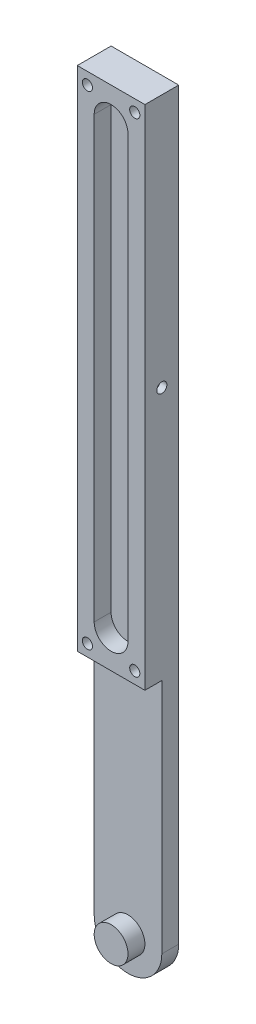
ISO-10303-21;
HEADER;
FILE_DESCRIPTION(('STEP AP214'),'2;1');
FILE_NAME('part.step','',(''),(''),'','','');
FILE_SCHEMA(('AUTOMOTIVE_DESIGN { 1 0 10303 214 1 1 1 1 }'));
ENDSEC;
DATA;
#1=APPLICATION_CONTEXT('core data for automotive mechanical design processes');
#2=APPLICATION_PROTOCOL_DEFINITION('international standard','automotive_design',2000,#1);
#3=PRODUCT_CONTEXT('',#1,'mechanical');
#4=PRODUCT('Part','Part','',(#3));
#5=PRODUCT_RELATED_PRODUCT_CATEGORY('part','',(#4));
#6=PRODUCT_DEFINITION_FORMATION('','',#4);
#7=PRODUCT_DEFINITION_CONTEXT('part definition',#1,'design');
#8=PRODUCT_DEFINITION('design','',#6,#7);
#9=PRODUCT_DEFINITION_SHAPE('','',#8);
#10=(LENGTH_UNIT() NAMED_UNIT(*) SI_UNIT(.MILLI.,.METRE.));
#11=(NAMED_UNIT(*) PLANE_ANGLE_UNIT() SI_UNIT($,.RADIAN.));
#12=(NAMED_UNIT(*) SI_UNIT($,.STERADIAN.) SOLID_ANGLE_UNIT());
#13=UNCERTAINTY_MEASURE_WITH_UNIT(LENGTH_MEASURE(1.E-05),#10,'distance_accuracy_value','');
#14=(GEOMETRIC_REPRESENTATION_CONTEXT(3) GLOBAL_UNCERTAINTY_ASSIGNED_CONTEXT((#13)) GLOBAL_UNIT_ASSIGNED_CONTEXT((#10,
#11,#12)) REPRESENTATION_CONTEXT('',''));
#15=CARTESIAN_POINT('',(0.,0.,0.));
#16=DIRECTION('',(0.,0.,1.));
#17=DIRECTION('',(1.,0.,0.));
#18=AXIS2_PLACEMENT_3D('',#15,#16,#17);
#19=CARTESIAN_POINT('',(10.,-150.,5.));
#20=DIRECTION('',(-1.,0.,0.));
#21=DIRECTION('',(0.,-1.,0.));
#22=AXIS2_PLACEMENT_3D('',#19,#20,#21);
#23=PLANE('',#22);
#24=DIRECTION('',(0.,1.,0.));
#25=VECTOR('',#24,1.);
#26=CARTESIAN_POINT('',(10.,-150.,-5.));
#27=LINE('',#26,#25);
#28=CARTESIAN_POINT('',(10.,-220.,-5.));
#29=VERTEX_POINT('',#28);
#30=CARTESIAN_POINT('',(10.,0.,-5.));
#31=VERTEX_POINT('',#30);
#32=EDGE_CURVE('E94',#29,#31,#27,.T.);
#33=ORIENTED_EDGE('',*,*,#32,.T.);
#34=DIRECTION('',(0.,0.,-1.));
#35=VECTOR('',#34,1.);
#36=CARTESIAN_POINT('',(10.,0.,5.));
#37=LINE('',#36,#35);
#38=CARTESIAN_POINT('',(10.,0.,5.));
#39=VERTEX_POINT('',#38);
#40=EDGE_CURVE('E10',#39,#31,#37,.T.);
#41=ORIENTED_EDGE('',*,*,#40,.F.);
#42=DIRECTION('',(0.,1.,0.));
#43=VECTOR('',#42,1.);
#44=CARTESIAN_POINT('',(10.,-150.,5.));
#45=LINE('',#44,#43);
#46=CARTESIAN_POINT('',(10.,-150.,5.));
#47=VERTEX_POINT('',#46);
#48=EDGE_CURVE('E177',#47,#39,#45,.T.);
#49=ORIENTED_EDGE('',*,*,#48,.F.);
#50=DIRECTION('',(0.,0.,-1.));
#51=VECTOR('',#50,1.);
#52=CARTESIAN_POINT('',(10.,-150.,5.));
#53=LINE('',#52,#51);
#54=CARTESIAN_POINT('',(10.,-150.,0.));
#55=VERTEX_POINT('',#54);
#56=EDGE_CURVE('E186',#47,#55,#53,.T.);
#57=ORIENTED_EDGE('',*,*,#56,.T.);
#58=DIRECTION('',(0.,1.,0.));
#59=VECTOR('',#58,1.);
#60=CARTESIAN_POINT('',(10.,-150.,0.));
#61=LINE('',#60,#59);
#62=CARTESIAN_POINT('',(10.,-220.,0.));
#63=VERTEX_POINT('',#62);
#64=EDGE_CURVE('E110',#63,#55,#61,.T.);
#65=ORIENTED_EDGE('',*,*,#64,.F.);
#66=DIRECTION('',(0.,0.,1.));
#67=VECTOR('',#66,1.);
#68=CARTESIAN_POINT('',(10.,-220.,-87.4621125123532));
#69=LINE('',#68,#67);
#70=EDGE_CURVE('E107',#29,#63,#69,.T.);
#71=ORIENTED_EDGE('',*,*,#70,.F.);
#72=EDGE_LOOP('',(#33,#41,#49,#57,#65,#71));
#73=FACE_BOUND('',#72,.T.);
#74=CARTESIAN_POINT('',(10.,-75.,0.));
#75=DIRECTION('',(-1.,0.,0.));
#76=DIRECTION('',(0.,-1.,0.));
#77=AXIS2_PLACEMENT_3D('',#74,#75,#76);
#78=CIRCLE('',#77,1.5);
#79=CARTESIAN_POINT('',(10.,-76.5,0.));
#80=VERTEX_POINT('',#79);
#81=EDGE_CURVE('E211',#80,#80,#78,.T.);
#82=ORIENTED_EDGE('',*,*,#81,.T.);
#83=EDGE_LOOP('',(#82));
#84=FACE_BOUND('',#83,.T.);
#85=ADVANCED_FACE('F15',(#73,#84),#23,.F.);
#86=CARTESIAN_POINT('',(0.,-220.,0.));
#87=DIRECTION('',(0.,0.,1.));
#88=DIRECTION('',(0.,-1.,0.));
#89=AXIS2_PLACEMENT_3D('',#86,#87,#88);
#90=PLANE('',#89);
#91=DIRECTION('',(0.,-1.,0.));
#92=VECTOR('',#91,1.);
#93=CARTESIAN_POINT('',(-10.,-150.,0.));
#94=LINE('',#93,#92);
#95=CARTESIAN_POINT('',(-10.,-150.,0.));
#96=VERTEX_POINT('',#95);
#97=CARTESIAN_POINT('',(-10.,-220.,0.));
#98=VERTEX_POINT('',#97);
#99=EDGE_CURVE('E198',#96,#98,#94,.T.);
#100=ORIENTED_EDGE('',*,*,#99,.T.);
#101=CARTESIAN_POINT('',(0.,-220.,0.));
#102=DIRECTION('',(0.,0.,1.));
#103=DIRECTION('',(0.,-1.,0.));
#104=AXIS2_PLACEMENT_3D('',#101,#102,#103);
#105=CIRCLE('',#104,10.);
#106=EDGE_CURVE('E120',#98,#63,#105,.T.);
#107=ORIENTED_EDGE('',*,*,#106,.T.);
#108=ORIENTED_EDGE('',*,*,#64,.T.);
#109=DIRECTION('',(-1.,0.,0.));
#110=VECTOR('',#109,1.);
#111=CARTESIAN_POINT('',(-10.,-150.,0.));
#112=LINE('',#111,#110);
#113=EDGE_CURVE('E31',#55,#96,#112,.T.);
#114=ORIENTED_EDGE('',*,*,#113,.T.);
#115=EDGE_LOOP('',(#100,#107,#108,#114));
#116=FACE_BOUND('',#115,.T.);
#117=CARTESIAN_POINT('',(0.,-220.,0.));
#118=DIRECTION('',(0.,0.,1.));
#119=DIRECTION('',(0.,-1.,0.));
#120=AXIS2_PLACEMENT_3D('',#117,#118,#119);
#121=CIRCLE('',#120,5.);
#122=CARTESIAN_POINT('',(0.,-225.,0.));
#123=VERTEX_POINT('',#122);
#124=EDGE_CURVE('E205',#123,#123,#121,.T.);
#125=ORIENTED_EDGE('',*,*,#124,.F.);
#126=EDGE_LOOP('',(#125));
#127=FACE_BOUND('',#126,.T.);
#128=ADVANCED_FACE('F230',(#116,#127),#90,.T.);
#129=CARTESIAN_POINT('',(-10.,-150.,5.));
#130=DIRECTION('',(0.,1.,0.));
#131=DIRECTION('',(-1.,0.,0.));
#132=AXIS2_PLACEMENT_3D('',#129,#130,#131);
#133=PLANE('',#132);
#134=ORIENTED_EDGE('',*,*,#113,.F.);
#135=ORIENTED_EDGE('',*,*,#56,.F.);
#136=DIRECTION('',(1.,0.,0.));
#137=VECTOR('',#136,1.);
#138=CARTESIAN_POINT('',(-10.,-150.,5.));
#139=LINE('',#138,#137);
#140=CARTESIAN_POINT('',(-10.,-150.,5.));
#141=VERTEX_POINT('',#140);
#142=EDGE_CURVE('E185',#141,#47,#139,.T.);
#143=ORIENTED_EDGE('',*,*,#142,.F.);
#144=DIRECTION('',(0.,0.,-1.));
#145=VECTOR('',#144,1.);
#146=CARTESIAN_POINT('',(-10.,-150.,5.));
#147=LINE('',#146,#145);
#148=EDGE_CURVE('E196',#141,#96,#147,.T.);
#149=ORIENTED_EDGE('',*,*,#148,.T.);
#150=EDGE_LOOP('',(#134,#135,#143,#149));
#151=FACE_BOUND('',#150,.T.);
#152=ADVANCED_FACE('F234',(#151),#133,.F.);
#153=CARTESIAN_POINT('',(-10.,0.,5.));
#154=DIRECTION('',(0.,-1.,0.));
#155=DIRECTION('',(1.,0.,0.));
#156=AXIS2_PLACEMENT_3D('',#153,#154,#155);
#157=PLANE('',#156);
#158=DIRECTION('',(-1.,0.,0.));
#159=VECTOR('',#158,1.);
#160=CARTESIAN_POINT('',(-10.,0.,-5.));
#161=LINE('',#160,#159);
#162=CARTESIAN_POINT('',(-10.,0.,-5.));
#163=VERTEX_POINT('',#162);
#164=EDGE_CURVE('E101',#31,#163,#161,.T.);
#165=ORIENTED_EDGE('',*,*,#164,.T.);
#166=DIRECTION('',(0.,0.,-1.));
#167=VECTOR('',#166,1.);
#168=CARTESIAN_POINT('',(-10.,0.,5.));
#169=LINE('',#168,#167);
#170=CARTESIAN_POINT('',(-10.,0.,5.));
#171=VERTEX_POINT('',#170);
#172=EDGE_CURVE('E23',#171,#163,#169,.T.);
#173=ORIENTED_EDGE('',*,*,#172,.F.);
#174=DIRECTION('',(-1.,0.,0.));
#175=VECTOR('',#174,1.);
#176=CARTESIAN_POINT('',(-10.,0.,5.));
#177=LINE('',#176,#175);
#178=EDGE_CURVE('E180',#39,#171,#177,.T.);
#179=ORIENTED_EDGE('',*,*,#178,.F.);
#180=ORIENTED_EDGE('',*,*,#40,.T.);
#181=EDGE_LOOP('',(#165,#173,#179,#180));
#182=FACE_BOUND('',#181,.T.);
#183=ADVANCED_FACE('F240',(#182),#157,.F.);
#184=CARTESIAN_POINT('',(-10.,-150.,5.));
#185=DIRECTION('',(1.,0.,0.));
#186=DIRECTION('',(0.,1.,0.));
#187=AXIS2_PLACEMENT_3D('',#184,#185,#186);
#188=PLANE('',#187);
#189=DIRECTION('',(0.,-1.,0.));
#190=VECTOR('',#189,1.);
#191=CARTESIAN_POINT('',(-10.,-150.,-5.));
#192=LINE('',#191,#190);
#193=CARTESIAN_POINT('',(-10.,-220.,-5.));
#194=VERTEX_POINT('',#193);
#195=EDGE_CURVE('E181',#163,#194,#192,.T.);
#196=ORIENTED_EDGE('',*,*,#195,.T.);
#197=DIRECTION('',(0.,0.,1.));
#198=VECTOR('',#197,1.);
#199=CARTESIAN_POINT('',(-10.,-220.,-87.4621125123532));
#200=LINE('',#199,#198);
#201=EDGE_CURVE('E114',#194,#98,#200,.T.);
#202=ORIENTED_EDGE('',*,*,#201,.T.);
#203=ORIENTED_EDGE('',*,*,#99,.F.);
#204=ORIENTED_EDGE('',*,*,#148,.F.);
#205=DIRECTION('',(0.,-1.,0.));
#206=VECTOR('',#205,1.);
#207=CARTESIAN_POINT('',(-10.,-150.,5.));
#208=LINE('',#207,#206);
#209=EDGE_CURVE('E183',#171,#141,#208,.T.);
#210=ORIENTED_EDGE('',*,*,#209,.F.);
#211=ORIENTED_EDGE('',*,*,#172,.T.);
#212=EDGE_LOOP('',(#196,#202,#203,#204,#210,#211));
#213=FACE_BOUND('',#212,.T.);
#214=ADVANCED_FACE('F303',(#213),#188,.F.);
#215=CARTESIAN_POINT('',(0.,-75.,5.));
#216=DIRECTION('',(0.,0.,-1.));
#217=DIRECTION('',(0.,1.,0.));
#218=AXIS2_PLACEMENT_3D('',#215,#216,#217);
#219=PLANE('',#218);
#220=CARTESIAN_POINT('',(7.,-146.5,5.));
#221=DIRECTION('',(0.,0.,1.));
#222=DIRECTION('',(0.,-1.,0.));
#223=AXIS2_PLACEMENT_3D('',#220,#221,#222);
#224=CIRCLE('',#223,1.5);
#225=CARTESIAN_POINT('',(7.,-148.,5.));
#226=VERTEX_POINT('',#225);
#227=EDGE_CURVE('E124',#226,#226,#224,.T.);
#228=ORIENTED_EDGE('',*,*,#227,.F.);
#229=EDGE_LOOP('',(#228));
#230=FACE_BOUND('',#229,.T.);
#231=CARTESIAN_POINT('',(-7.,-146.5,5.));
#232=DIRECTION('',(0.,0.,1.));
#233=DIRECTION('',(0.,-1.,0.));
#234=AXIS2_PLACEMENT_3D('',#231,#232,#233);
#235=CIRCLE('',#234,1.5);
#236=CARTESIAN_POINT('',(-7.,-148.,5.));
#237=VERTEX_POINT('',#236);
#238=EDGE_CURVE('E128',#237,#237,#235,.T.);
#239=ORIENTED_EDGE('',*,*,#238,.F.);
#240=EDGE_LOOP('',(#239));
#241=FACE_BOUND('',#240,.T.);
#242=CARTESIAN_POINT('',(-7.,-3.5,5.));
#243=DIRECTION('',(0.,0.,1.));
#244=DIRECTION('',(0.,-1.,0.));
#245=AXIS2_PLACEMENT_3D('',#242,#243,#244);
#246=CIRCLE('',#245,1.5);
#247=CARTESIAN_POINT('',(-7.,-5.,5.));
#248=VERTEX_POINT('',#247);
#249=EDGE_CURVE('E134',#248,#248,#246,.T.);
#250=ORIENTED_EDGE('',*,*,#249,.F.);
#251=EDGE_LOOP('',(#250));
#252=FACE_BOUND('',#251,.T.);
#253=CARTESIAN_POINT('',(7.,-3.5,5.));
#254=DIRECTION('',(0.,0.,1.));
#255=DIRECTION('',(0.,-1.,0.));
#256=AXIS2_PLACEMENT_3D('',#253,#254,#255);
#257=CIRCLE('',#256,1.5);
#258=CARTESIAN_POINT('',(7.,-5.,5.));
#259=VERTEX_POINT('',#258);
#260=EDGE_CURVE('E140',#259,#259,#257,.T.);
#261=ORIENTED_EDGE('',*,*,#260,.F.);
#262=EDGE_LOOP('',(#261));
#263=FACE_BOUND('',#262,.T.);
#264=DIRECTION('',(0.,1.,0.));
#265=VECTOR('',#264,1.);
#266=CARTESIAN_POINT('',(5.,-140.,5.));
#267=LINE('',#266,#265);
#268=CARTESIAN_POINT('',(5.,-140.,5.));
#269=VERTEX_POINT('',#268);
#270=CARTESIAN_POINT('',(5.,-10.,5.));
#271=VERTEX_POINT('',#270);
#272=EDGE_CURVE('E163',#269,#271,#267,.T.);
#273=ORIENTED_EDGE('',*,*,#272,.F.);
#274=CARTESIAN_POINT('',(0.,-140.,5.));
#275=DIRECTION('',(0.,0.,1.));
#276=DIRECTION('',(0.,-1.,0.));
#277=AXIS2_PLACEMENT_3D('',#274,#275,#276);
#278=CIRCLE('',#277,5.);
#279=CARTESIAN_POINT('',(-5.,-140.,5.));
#280=VERTEX_POINT('',#279);
#281=EDGE_CURVE('E39',#280,#269,#278,.T.);
#282=ORIENTED_EDGE('',*,*,#281,.F.);
#283=DIRECTION('',(0.,-1.,0.));
#284=VECTOR('',#283,1.);
#285=CARTESIAN_POINT('',(-5.,-140.,5.));
#286=LINE('',#285,#284);
#287=CARTESIAN_POINT('',(-5.,-10.,5.));
#288=VERTEX_POINT('',#287);
#289=EDGE_CURVE('E152',#288,#280,#286,.T.);
#290=ORIENTED_EDGE('',*,*,#289,.F.);
#291=CARTESIAN_POINT('',(0.,-10.,5.));
#292=DIRECTION('',(0.,0.,1.));
#293=DIRECTION('',(0.,-1.,0.));
#294=AXIS2_PLACEMENT_3D('',#291,#292,#293);
#295=CIRCLE('',#294,5.);
#296=EDGE_CURVE('E166',#271,#288,#295,.T.);
#297=ORIENTED_EDGE('',*,*,#296,.F.);
#298=EDGE_LOOP('',(#273,#282,#290,#297));
#299=FACE_BOUND('',#298,.T.);
#300=ORIENTED_EDGE('',*,*,#48,.T.);
#301=ORIENTED_EDGE('',*,*,#178,.T.);
#302=ORIENTED_EDGE('',*,*,#209,.T.);
#303=ORIENTED_EDGE('',*,*,#142,.T.);
#304=EDGE_LOOP('',(#300,#301,#302,#303));
#305=FACE_BOUND('',#304,.T.);
#306=ADVANCED_FACE('F300',(#230,#241,#252,#263,#299,#305),#219,.F.);
#307=CARTESIAN_POINT('',(0.,-75.,-5.));
#308=DIRECTION('',(0.,0.,-1.));
#309=DIRECTION('',(0.,1.,0.));
#310=AXIS2_PLACEMENT_3D('',#307,#308,#309);
#311=PLANE('',#310);
#312=ORIENTED_EDGE('',*,*,#32,.F.);
#313=CARTESIAN_POINT('',(0.,-220.,-5.));
#314=DIRECTION('',(0.,0.,-1.));
#315=DIRECTION('',(0.,1.,0.));
#316=AXIS2_PLACEMENT_3D('',#313,#314,#315);
#317=CIRCLE('',#316,10.);
#318=EDGE_CURVE('E99',#194,#29,#317,.F.);
#319=ORIENTED_EDGE('',*,*,#318,.F.);
#320=ORIENTED_EDGE('',*,*,#195,.F.);
#321=ORIENTED_EDGE('',*,*,#164,.F.);
#322=EDGE_LOOP('',(#312,#319,#320,#321));
#323=FACE_BOUND('',#322,.T.);
#324=ADVANCED_FACE('F96',(#323),#311,.T.);
#325=CARTESIAN_POINT('',(0.,-140.,0.));
#326=DIRECTION('',(0.,0.,1.));
#327=DIRECTION('',(0.,-1.,0.));
#328=AXIS2_PLACEMENT_3D('',#325,#326,#327);
#329=CYLINDRICAL_SURFACE('',#328,5.);
#330=ORIENTED_EDGE('',*,*,#281,.T.);
#331=DIRECTION('',(0.,0.,1.));
#332=VECTOR('',#331,1.);
#333=CARTESIAN_POINT('',(5.,-140.,0.));
#334=LINE('',#333,#332);
#335=CARTESIAN_POINT('',(5.,-140.,0.));
#336=VERTEX_POINT('',#335);
#337=EDGE_CURVE('E161',#336,#269,#334,.T.);
#338=ORIENTED_EDGE('',*,*,#337,.F.);
#339=CARTESIAN_POINT('',(0.,-140.,0.));
#340=DIRECTION('',(0.,0.,1.));
#341=DIRECTION('',(0.,-1.,0.));
#342=AXIS2_PLACEMENT_3D('',#339,#340,#341);
#343=CIRCLE('',#342,5.);
#344=CARTESIAN_POINT('',(-5.,-140.,0.));
#345=VERTEX_POINT('',#344);
#346=EDGE_CURVE('E148',#345,#336,#343,.T.);
#347=ORIENTED_EDGE('',*,*,#346,.F.);
#348=DIRECTION('',(0.,0.,1.));
#349=VECTOR('',#348,1.);
#350=CARTESIAN_POINT('',(-5.,-140.,0.));
#351=LINE('',#350,#349);
#352=EDGE_CURVE('E104',#345,#280,#351,.T.);
#353=ORIENTED_EDGE('',*,*,#352,.T.);
#354=EDGE_LOOP('',(#330,#338,#347,#353));
#355=FACE_BOUND('',#354,.T.);
#356=ADVANCED_FACE('F290',(#355),#329,.F.);
#357=CARTESIAN_POINT('',(-5.,-140.,0.));
#358=DIRECTION('',(-1.,0.,0.));
#359=DIRECTION('',(0.,-1.,0.));
#360=AXIS2_PLACEMENT_3D('',#357,#358,#359);
#361=PLANE('',#360);
#362=ORIENTED_EDGE('',*,*,#289,.T.);
#363=ORIENTED_EDGE('',*,*,#352,.F.);
#364=DIRECTION('',(0.,-1.,0.));
#365=VECTOR('',#364,1.);
#366=CARTESIAN_POINT('',(-5.,-140.,0.));
#367=LINE('',#366,#365);
#368=CARTESIAN_POINT('',(-5.,-10.,0.));
#369=VERTEX_POINT('',#368);
#370=EDGE_CURVE('E158',#369,#345,#367,.T.);
#371=ORIENTED_EDGE('',*,*,#370,.F.);
#372=DIRECTION('',(0.,0.,1.));
#373=VECTOR('',#372,1.);
#374=CARTESIAN_POINT('',(-5.,-10.,0.));
#375=LINE('',#374,#373);
#376=EDGE_CURVE('E172',#369,#288,#375,.T.);
#377=ORIENTED_EDGE('',*,*,#376,.T.);
#378=EDGE_LOOP('',(#362,#363,#371,#377));
#379=FACE_BOUND('',#378,.T.);
#380=ADVANCED_FACE('F286',(#379),#361,.F.);
#381=CARTESIAN_POINT('',(0.,-10.,0.));
#382=DIRECTION('',(0.,0.,1.));
#383=DIRECTION('',(0.,-1.,0.));
#384=AXIS2_PLACEMENT_3D('',#381,#382,#383);
#385=CYLINDRICAL_SURFACE('',#384,5.);
#386=ORIENTED_EDGE('',*,*,#296,.T.);
#387=ORIENTED_EDGE('',*,*,#376,.F.);
#388=CARTESIAN_POINT('',(0.,-10.,0.));
#389=DIRECTION('',(0.,0.,1.));
#390=DIRECTION('',(0.,-1.,0.));
#391=AXIS2_PLACEMENT_3D('',#388,#389,#390);
#392=CIRCLE('',#391,5.);
#393=CARTESIAN_POINT('',(5.,-10.,0.));
#394=VERTEX_POINT('',#393);
#395=EDGE_CURVE('E155',#394,#369,#392,.T.);
#396=ORIENTED_EDGE('',*,*,#395,.F.);
#397=DIRECTION('',(0.,0.,1.));
#398=VECTOR('',#397,1.);
#399=CARTESIAN_POINT('',(5.,-10.,0.));
#400=LINE('',#399,#398);
#401=EDGE_CURVE('E174',#394,#271,#400,.T.);
#402=ORIENTED_EDGE('',*,*,#401,.T.);
#403=EDGE_LOOP('',(#386,#387,#396,#402));
#404=FACE_BOUND('',#403,.T.);
#405=ADVANCED_FACE('F289',(#404),#385,.F.);
#406=CARTESIAN_POINT('',(5.,-140.,0.));
#407=DIRECTION('',(1.,0.,0.));
#408=DIRECTION('',(0.,1.,0.));
#409=AXIS2_PLACEMENT_3D('',#406,#407,#408);
#410=PLANE('',#409);
#411=ORIENTED_EDGE('',*,*,#272,.T.);
#412=ORIENTED_EDGE('',*,*,#401,.F.);
#413=DIRECTION('',(0.,1.,0.));
#414=VECTOR('',#413,1.);
#415=CARTESIAN_POINT('',(5.,-140.,0.));
#416=LINE('',#415,#414);
#417=EDGE_CURVE('E151',#336,#394,#416,.T.);
#418=ORIENTED_EDGE('',*,*,#417,.F.);
#419=ORIENTED_EDGE('',*,*,#337,.T.);
#420=EDGE_LOOP('',(#411,#412,#418,#419));
#421=FACE_BOUND('',#420,.T.);
#422=ADVANCED_FACE('F284',(#421),#410,.F.);
#423=CARTESIAN_POINT('',(0.,-140.,0.));
#424=DIRECTION('',(0.,0.,1.));
#425=DIRECTION('',(0.,-1.,0.));
#426=AXIS2_PLACEMENT_3D('',#423,#424,#425);
#427=PLANE('',#426);
#428=ORIENTED_EDGE('',*,*,#346,.T.);
#429=ORIENTED_EDGE('',*,*,#417,.T.);
#430=ORIENTED_EDGE('',*,*,#395,.T.);
#431=ORIENTED_EDGE('',*,*,#370,.T.);
#432=EDGE_LOOP('',(#428,#429,#430,#431));
#433=FACE_BOUND('',#432,.T.);
#434=ADVANCED_FACE('F280',(#433),#427,.T.);
#435=CARTESIAN_POINT('',(7.,-3.5,0.));
#436=DIRECTION('',(0.,0.,1.));
#437=DIRECTION('',(0.,-1.,0.));
#438=AXIS2_PLACEMENT_3D('',#435,#436,#437);
#439=CYLINDRICAL_SURFACE('',#438,1.5);
#440=CARTESIAN_POINT('',(7.,-3.5,0.));
#441=DIRECTION('',(0.,0.,1.));
#442=DIRECTION('',(0.,-1.,0.));
#443=AXIS2_PLACEMENT_3D('',#440,#441,#442);
#444=CIRCLE('',#443,1.5);
#445=CARTESIAN_POINT('',(7.,-5.,0.));
#446=VERTEX_POINT('',#445);
#447=EDGE_CURVE('E143',#446,#446,#444,.T.);
#448=ORIENTED_EDGE('',*,*,#447,.F.);
#449=EDGE_LOOP('',(#448));
#450=FACE_BOUND('',#449,.T.);
#451=ORIENTED_EDGE('',*,*,#260,.T.);
#452=EDGE_LOOP('',(#451));
#453=FACE_BOUND('',#452,.T.);
#454=ADVANCED_FACE('F276',(#450,#453),#439,.F.);
#455=CARTESIAN_POINT('',(7.,-3.5,0.));
#456=DIRECTION('',(0.,0.,1.));
#457=DIRECTION('',(0.,-1.,0.));
#458=AXIS2_PLACEMENT_3D('',#455,#456,#457);
#459=PLANE('',#458);
#460=ORIENTED_EDGE('',*,*,#447,.T.);
#461=EDGE_LOOP('',(#460));
#462=FACE_BOUND('',#461,.T.);
#463=ADVANCED_FACE('F272',(#462),#459,.T.);
#464=CARTESIAN_POINT('',(-7.,-3.5,0.));
#465=DIRECTION('',(0.,0.,1.));
#466=DIRECTION('',(0.,-1.,0.));
#467=AXIS2_PLACEMENT_3D('',#464,#465,#466);
#468=CYLINDRICAL_SURFACE('',#467,1.5);
#469=CARTESIAN_POINT('',(-7.,-3.5,0.));
#470=DIRECTION('',(0.,0.,1.));
#471=DIRECTION('',(0.,-1.,0.));
#472=AXIS2_PLACEMENT_3D('',#469,#470,#471);
#473=CIRCLE('',#472,1.5);
#474=CARTESIAN_POINT('',(-7.,-5.,0.));
#475=VERTEX_POINT('',#474);
#476=EDGE_CURVE('E137',#475,#475,#473,.T.);
#477=ORIENTED_EDGE('',*,*,#476,.F.);
#478=EDGE_LOOP('',(#477));
#479=FACE_BOUND('',#478,.T.);
#480=ORIENTED_EDGE('',*,*,#249,.T.);
#481=EDGE_LOOP('',(#480));
#482=FACE_BOUND('',#481,.T.);
#483=ADVANCED_FACE('F268',(#479,#482),#468,.F.);
#484=CARTESIAN_POINT('',(-7.,-3.5,0.));
#485=DIRECTION('',(0.,0.,1.));
#486=DIRECTION('',(0.,-1.,0.));
#487=AXIS2_PLACEMENT_3D('',#484,#485,#486);
#488=PLANE('',#487);
#489=ORIENTED_EDGE('',*,*,#476,.T.);
#490=EDGE_LOOP('',(#489));
#491=FACE_BOUND('',#490,.T.);
#492=ADVANCED_FACE('F264',(#491),#488,.T.);
#493=CARTESIAN_POINT('',(-7.,-146.5,0.));
#494=DIRECTION('',(0.,0.,1.));
#495=DIRECTION('',(0.,-1.,0.));
#496=AXIS2_PLACEMENT_3D('',#493,#494,#495);
#497=CYLINDRICAL_SURFACE('',#496,1.5);
#498=CARTESIAN_POINT('',(-7.,-146.5,0.));
#499=DIRECTION('',(0.,0.,1.));
#500=DIRECTION('',(0.,-1.,0.));
#501=AXIS2_PLACEMENT_3D('',#498,#499,#500);
#502=CIRCLE('',#501,1.5);
#503=CARTESIAN_POINT('',(-7.,-148.,0.));
#504=VERTEX_POINT('',#503);
#505=EDGE_CURVE('E131',#504,#504,#502,.T.);
#506=ORIENTED_EDGE('',*,*,#505,.F.);
#507=EDGE_LOOP('',(#506));
#508=FACE_BOUND('',#507,.T.);
#509=ORIENTED_EDGE('',*,*,#238,.T.);
#510=EDGE_LOOP('',(#509));
#511=FACE_BOUND('',#510,.T.);
#512=ADVANCED_FACE('F260',(#508,#511),#497,.F.);
#513=CARTESIAN_POINT('',(-7.,-146.5,0.));
#514=DIRECTION('',(0.,0.,1.));
#515=DIRECTION('',(0.,-1.,0.));
#516=AXIS2_PLACEMENT_3D('',#513,#514,#515);
#517=PLANE('',#516);
#518=ORIENTED_EDGE('',*,*,#505,.T.);
#519=EDGE_LOOP('',(#518));
#520=FACE_BOUND('',#519,.T.);
#521=ADVANCED_FACE('F256',(#520),#517,.T.);
#522=CARTESIAN_POINT('',(7.,-146.5,0.));
#523=DIRECTION('',(0.,0.,1.));
#524=DIRECTION('',(0.,-1.,0.));
#525=AXIS2_PLACEMENT_3D('',#522,#523,#524);
#526=CYLINDRICAL_SURFACE('',#525,1.5);
#527=CARTESIAN_POINT('',(7.,-146.5,0.));
#528=DIRECTION('',(0.,0.,1.));
#529=DIRECTION('',(0.,-1.,0.));
#530=AXIS2_PLACEMENT_3D('',#527,#528,#529);
#531=CIRCLE('',#530,1.5);
#532=CARTESIAN_POINT('',(7.,-148.,0.));
#533=VERTEX_POINT('',#532);
#534=EDGE_CURVE('E125',#533,#533,#531,.T.);
#535=ORIENTED_EDGE('',*,*,#534,.F.);
#536=EDGE_LOOP('',(#535));
#537=FACE_BOUND('',#536,.T.);
#538=ORIENTED_EDGE('',*,*,#227,.T.);
#539=EDGE_LOOP('',(#538));
#540=FACE_BOUND('',#539,.T.);
#541=ADVANCED_FACE('F252',(#537,#540),#526,.F.);
#542=CARTESIAN_POINT('',(7.,-146.5,0.));
#543=DIRECTION('',(0.,0.,1.));
#544=DIRECTION('',(0.,-1.,0.));
#545=AXIS2_PLACEMENT_3D('',#542,#543,#544);
#546=PLANE('',#545);
#547=ORIENTED_EDGE('',*,*,#534,.T.);
#548=EDGE_LOOP('',(#547));
#549=FACE_BOUND('',#548,.T.);
#550=ADVANCED_FACE('F249',(#549),#546,.T.);
#551=CARTESIAN_POINT('',(0.,-220.,-87.4621125123532));
#552=DIRECTION('',(0.,0.,1.));
#553=DIRECTION('',(0.,-1.,0.));
#554=AXIS2_PLACEMENT_3D('',#551,#552,#553);
#555=CYLINDRICAL_SURFACE('',#554,10.);
#556=ORIENTED_EDGE('',*,*,#201,.F.);
#557=ORIENTED_EDGE('',*,*,#318,.T.);
#558=ORIENTED_EDGE('',*,*,#70,.T.);
#559=ORIENTED_EDGE('',*,*,#106,.F.);
#560=EDGE_LOOP('',(#556,#557,#558,#559));
#561=FACE_BOUND('',#560,.T.);
#562=ADVANCED_FACE('F116',(#561),#555,.T.);
#563=CARTESIAN_POINT('',(0.,-220.,5.));
#564=DIRECTION('',(0.,0.,-1.));
#565=DIRECTION('',(0.,1.,0.));
#566=AXIS2_PLACEMENT_3D('',#563,#564,#565);
#567=CYLINDRICAL_SURFACE('',#566,5.);
#568=CARTESIAN_POINT('',(0.,-220.,5.));
#569=DIRECTION('',(0.,0.,1.));
#570=DIRECTION('',(0.,-1.,0.));
#571=AXIS2_PLACEMENT_3D('',#568,#569,#570);
#572=CIRCLE('',#571,5.);
#573=CARTESIAN_POINT('',(0.,-225.,5.));
#574=VERTEX_POINT('',#573);
#575=EDGE_CURVE('E201',#574,#574,#572,.T.);
#576=ORIENTED_EDGE('',*,*,#575,.F.);
#577=EDGE_LOOP('',(#576));
#578=FACE_BOUND('',#577,.T.);
#579=ORIENTED_EDGE('',*,*,#124,.T.);
#580=EDGE_LOOP('',(#579));
#581=FACE_BOUND('',#580,.T.);
#582=ADVANCED_FACE('F245',(#578,#581),#567,.T.);
#583=CARTESIAN_POINT('',(0.,-220.,5.));
#584=DIRECTION('',(0.,0.,1.));
#585=DIRECTION('',(0.,-1.,0.));
#586=AXIS2_PLACEMENT_3D('',#583,#584,#585);
#587=PLANE('',#586);
#588=ORIENTED_EDGE('',*,*,#575,.T.);
#589=EDGE_LOOP('',(#588));
#590=FACE_BOUND('',#589,.T.);
#591=ADVANCED_FACE('F227',(#590),#587,.T.);
#592=CARTESIAN_POINT('',(8.,-75.,0.));
#593=DIRECTION('',(1.,0.,0.));
#594=DIRECTION('',(0.,1.,0.));
#595=AXIS2_PLACEMENT_3D('',#592,#593,#594);
#596=CYLINDRICAL_SURFACE('',#595,1.5);
#597=CARTESIAN_POINT('',(8.,-75.,0.));
#598=DIRECTION('',(-1.,0.,0.));
#599=DIRECTION('',(0.,-1.,0.));
#600=AXIS2_PLACEMENT_3D('',#597,#598,#599);
#601=CIRCLE('',#600,1.5);
#602=CARTESIAN_POINT('',(8.,-76.5,0.));
#603=VERTEX_POINT('',#602);
#604=EDGE_CURVE('E208',#603,#603,#601,.T.);
#605=ORIENTED_EDGE('',*,*,#604,.T.);
#606=EDGE_LOOP('',(#605));
#607=FACE_BOUND('',#606,.T.);
#608=ORIENTED_EDGE('',*,*,#81,.F.);
#609=EDGE_LOOP('',(#608));
#610=FACE_BOUND('',#609,.T.);
#611=ADVANCED_FACE('F217',(#607,#610),#596,.F.);
#612=CARTESIAN_POINT('',(8.,-75.,0.));
#613=DIRECTION('',(-1.,0.,0.));
#614=DIRECTION('',(0.,-1.,0.));
#615=AXIS2_PLACEMENT_3D('',#612,#613,#614);
#616=PLANE('',#615);
#617=ORIENTED_EDGE('',*,*,#604,.F.);
#618=EDGE_LOOP('',(#617));
#619=FACE_BOUND('',#618,.T.);
#620=ADVANCED_FACE('F220',(#619),#616,.F.);
#621=CLOSED_SHELL('',(#85,#128,#152,#183,#214,#306,#324,#356,#380,#405,#422,#434,#454,#463,#483,
#492,#512,#521,#541,#550,#562,#582,#591,#611,#620));
#622=MANIFOLD_SOLID_BREP('B1',#621);
#623=ADVANCED_BREP_SHAPE_REPRESENTATION('',(#18,#622),#14);
#624=SHAPE_DEFINITION_REPRESENTATION(#9,#623);
ENDSEC;
END-ISO-10303-21;
